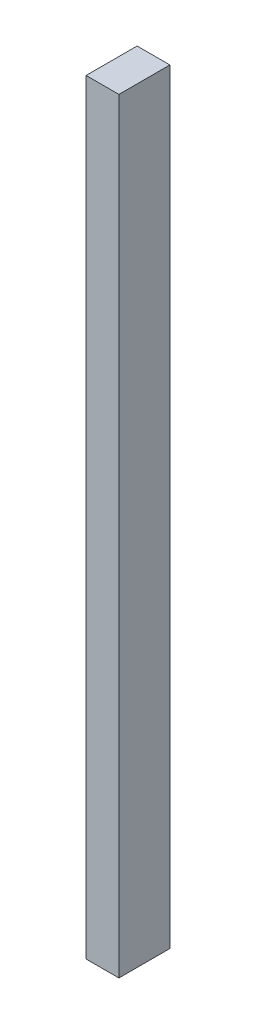
ISO-10303-21;
HEADER;
FILE_DESCRIPTION(('STEP AP214'),'2;1');
FILE_NAME('part.step','',(''),(''),'','','');
FILE_SCHEMA(('AUTOMOTIVE_DESIGN { 1 0 10303 214 1 1 1 1 }'));
ENDSEC;
DATA;
#1=APPLICATION_CONTEXT('core data for automotive mechanical design processes');
#2=APPLICATION_PROTOCOL_DEFINITION('international standard','automotive_design',2000,#1);
#3=PRODUCT_CONTEXT('',#1,'mechanical');
#4=PRODUCT('Part','Part','',(#3));
#5=PRODUCT_RELATED_PRODUCT_CATEGORY('part','',(#4));
#6=PRODUCT_DEFINITION_FORMATION('','',#4);
#7=PRODUCT_DEFINITION_CONTEXT('part definition',#1,'design');
#8=PRODUCT_DEFINITION('design','',#6,#7);
#9=PRODUCT_DEFINITION_SHAPE('','',#8);
#10=(LENGTH_UNIT() NAMED_UNIT(*) SI_UNIT(.MILLI.,.METRE.));
#11=(NAMED_UNIT(*) PLANE_ANGLE_UNIT() SI_UNIT($,.RADIAN.));
#12=(NAMED_UNIT(*) SI_UNIT($,.STERADIAN.) SOLID_ANGLE_UNIT());
#13=UNCERTAINTY_MEASURE_WITH_UNIT(LENGTH_MEASURE(1.E-05),#10,'distance_accuracy_value','');
#14=(GEOMETRIC_REPRESENTATION_CONTEXT(3) GLOBAL_UNCERTAINTY_ASSIGNED_CONTEXT((#13)) GLOBAL_UNIT_ASSIGNED_CONTEXT((#10,
#11,#12)) REPRESENTATION_CONTEXT('',''));
#15=CARTESIAN_POINT('',(0.,0.,0.));
#16=DIRECTION('',(0.,0.,1.));
#17=DIRECTION('',(1.,0.,0.));
#18=AXIS2_PLACEMENT_3D('',#15,#16,#17);
#19=CARTESIAN_POINT('',(0.,1050.,0.));
#20=DIRECTION('',(1.,0.,0.));
#21=DIRECTION('',(0.,0.,-1.));
#22=AXIS2_PLACEMENT_3D('',#19,#20,#21);
#23=PLANE('',#22);
#24=DIRECTION('',(0.,0.,1.));
#25=VECTOR('',#24,1.);
#26=CARTESIAN_POINT('',(0.,0.,0.));
#27=LINE('',#26,#25);
#28=CARTESIAN_POINT('',(0.,0.,-70.));
#29=VERTEX_POINT('',#28);
#30=CARTESIAN_POINT('',(0.,0.,0.));
#31=VERTEX_POINT('',#30);
#32=EDGE_CURVE('E98',#29,#31,#27,.T.);
#33=ORIENTED_EDGE('',*,*,#32,.T.);
#34=DIRECTION('',(0.,-1.,0.));
#35=VECTOR('',#34,1.);
#36=CARTESIAN_POINT('',(0.,1050.,0.));
#37=LINE('',#36,#35);
#38=CARTESIAN_POINT('',(0.,1050.,0.));
#39=VERTEX_POINT('',#38);
#40=EDGE_CURVE('E11',#39,#31,#37,.T.);
#41=ORIENTED_EDGE('',*,*,#40,.F.);
#42=DIRECTION('',(0.,0.,1.));
#43=VECTOR('',#42,1.);
#44=CARTESIAN_POINT('',(0.,1050.,0.));
#45=LINE('',#44,#43);
#46=CARTESIAN_POINT('',(0.,1050.,-70.));
#47=VERTEX_POINT('',#46);
#48=EDGE_CURVE('E86',#47,#39,#45,.T.);
#49=ORIENTED_EDGE('',*,*,#48,.F.);
#50=DIRECTION('',(0.,-1.,0.));
#51=VECTOR('',#50,1.);
#52=CARTESIAN_POINT('',(0.,1050.,-70.));
#53=LINE('',#52,#51);
#54=EDGE_CURVE('E94',#47,#29,#53,.T.);
#55=ORIENTED_EDGE('',*,*,#54,.T.);
#56=EDGE_LOOP('',(#33,#41,#49,#55));
#57=FACE_BOUND('',#56,.T.);
#58=ADVANCED_FACE('F35',(#57),#23,.F.);
#59=CARTESIAN_POINT('',(0.,1050.,0.));
#60=DIRECTION('',(0.,0.,-1.));
#61=DIRECTION('',(-1.,0.,0.));
#62=AXIS2_PLACEMENT_3D('',#59,#60,#61);
#63=PLANE('',#62);
#64=DIRECTION('',(1.,0.,0.));
#65=VECTOR('',#64,1.);
#66=CARTESIAN_POINT('',(0.,0.,0.));
#67=LINE('',#66,#65);
#68=CARTESIAN_POINT('',(45.,0.,0.));
#69=VERTEX_POINT('',#68);
#70=EDGE_CURVE('E90',#31,#69,#67,.T.);
#71=ORIENTED_EDGE('',*,*,#70,.T.);
#72=DIRECTION('',(0.,-1.,0.));
#73=VECTOR('',#72,1.);
#74=CARTESIAN_POINT('',(45.,1050.,0.));
#75=LINE('',#74,#73);
#76=CARTESIAN_POINT('',(45.,1050.,0.));
#77=VERTEX_POINT('',#76);
#78=EDGE_CURVE('E43',#77,#69,#75,.T.);
#79=ORIENTED_EDGE('',*,*,#78,.F.);
#80=DIRECTION('',(1.,0.,0.));
#81=VECTOR('',#80,1.);
#82=CARTESIAN_POINT('',(0.,1050.,0.));
#83=LINE('',#82,#81);
#84=EDGE_CURVE('E81',#39,#77,#83,.T.);
#85=ORIENTED_EDGE('',*,*,#84,.F.);
#86=ORIENTED_EDGE('',*,*,#40,.T.);
#87=EDGE_LOOP('',(#71,#79,#85,#86));
#88=FACE_BOUND('',#87,.T.);
#89=ADVANCED_FACE('F89',(#88),#63,.F.);
#90=CARTESIAN_POINT('',(45.,1050.,0.));
#91=DIRECTION('',(-1.,0.,0.));
#92=DIRECTION('',(0.,0.,1.));
#93=AXIS2_PLACEMENT_3D('',#90,#91,#92);
#94=PLANE('',#93);
#95=DIRECTION('',(0.,0.,-1.));
#96=VECTOR('',#95,1.);
#97=CARTESIAN_POINT('',(45.,0.,0.));
#98=LINE('',#97,#96);
#99=CARTESIAN_POINT('',(45.,0.,-70.));
#100=VERTEX_POINT('',#99);
#101=EDGE_CURVE('E68',#69,#100,#98,.T.);
#102=ORIENTED_EDGE('',*,*,#101,.T.);
#103=DIRECTION('',(0.,-1.,0.));
#104=VECTOR('',#103,1.);
#105=CARTESIAN_POINT('',(45.,1050.,-70.));
#106=LINE('',#105,#104);
#107=CARTESIAN_POINT('',(45.,1050.,-70.));
#108=VERTEX_POINT('',#107);
#109=EDGE_CURVE('E91',#108,#100,#106,.T.);
#110=ORIENTED_EDGE('',*,*,#109,.F.);
#111=DIRECTION('',(0.,0.,-1.));
#112=VECTOR('',#111,1.);
#113=CARTESIAN_POINT('',(45.,1050.,0.));
#114=LINE('',#113,#112);
#115=EDGE_CURVE('E84',#77,#108,#114,.T.);
#116=ORIENTED_EDGE('',*,*,#115,.F.);
#117=ORIENTED_EDGE('',*,*,#78,.T.);
#118=EDGE_LOOP('',(#102,#110,#116,#117));
#119=FACE_BOUND('',#118,.T.);
#120=ADVANCED_FACE('F92',(#119),#94,.F.);
#121=CARTESIAN_POINT('',(0.,1050.,-70.));
#122=DIRECTION('',(0.,0.,1.));
#123=DIRECTION('',(1.,0.,0.));
#124=AXIS2_PLACEMENT_3D('',#121,#122,#123);
#125=PLANE('',#124);
#126=DIRECTION('',(-1.,0.,0.));
#127=VECTOR('',#126,1.);
#128=CARTESIAN_POINT('',(0.,0.,-70.));
#129=LINE('',#128,#127);
#130=EDGE_CURVE('E74',#100,#29,#129,.T.);
#131=ORIENTED_EDGE('',*,*,#130,.T.);
#132=ORIENTED_EDGE('',*,*,#54,.F.);
#133=DIRECTION('',(-1.,0.,0.));
#134=VECTOR('',#133,1.);
#135=CARTESIAN_POINT('',(0.,1050.,-70.));
#136=LINE('',#135,#134);
#137=EDGE_CURVE('E51',#108,#47,#136,.T.);
#138=ORIENTED_EDGE('',*,*,#137,.F.);
#139=ORIENTED_EDGE('',*,*,#109,.T.);
#140=EDGE_LOOP('',(#131,#132,#138,#139));
#141=FACE_BOUND('',#140,.T.);
#142=ADVANCED_FACE('F105',(#141),#125,.F.);
#143=CARTESIAN_POINT('',(0.,1050.,0.));
#144=DIRECTION('',(0.,-1.,0.));
#145=DIRECTION('',(0.,0.,-1.));
#146=AXIS2_PLACEMENT_3D('',#143,#144,#145);
#147=PLANE('',#146);
#148=ORIENTED_EDGE('',*,*,#48,.T.);
#149=ORIENTED_EDGE('',*,*,#84,.T.);
#150=ORIENTED_EDGE('',*,*,#115,.T.);
#151=ORIENTED_EDGE('',*,*,#137,.T.);
#152=EDGE_LOOP('',(#148,#149,#150,#151));
#153=FACE_BOUND('',#152,.T.);
#154=ADVANCED_FACE('F82',(#153),#147,.F.);
#155=CARTESIAN_POINT('',(0.,0.,0.));
#156=DIRECTION('',(0.,-1.,0.));
#157=DIRECTION('',(0.,0.,-1.));
#158=AXIS2_PLACEMENT_3D('',#155,#156,#157);
#159=PLANE('',#158);
#160=ORIENTED_EDGE('',*,*,#32,.F.);
#161=ORIENTED_EDGE('',*,*,#130,.F.);
#162=ORIENTED_EDGE('',*,*,#101,.F.);
#163=ORIENTED_EDGE('',*,*,#70,.F.);
#164=EDGE_LOOP('',(#160,#161,#162,#163));
#165=FACE_BOUND('',#164,.T.);
#166=ADVANCED_FACE('F108',(#165),#159,.T.);
#167=CLOSED_SHELL('',(#58,#89,#120,#142,#154,#166));
#168=MANIFOLD_SOLID_BREP('B2',#167);
#169=ADVANCED_BREP_SHAPE_REPRESENTATION('',(#18,#168),#14);
#170=SHAPE_DEFINITION_REPRESENTATION(#9,#169);
ENDSEC;
END-ISO-10303-21;
